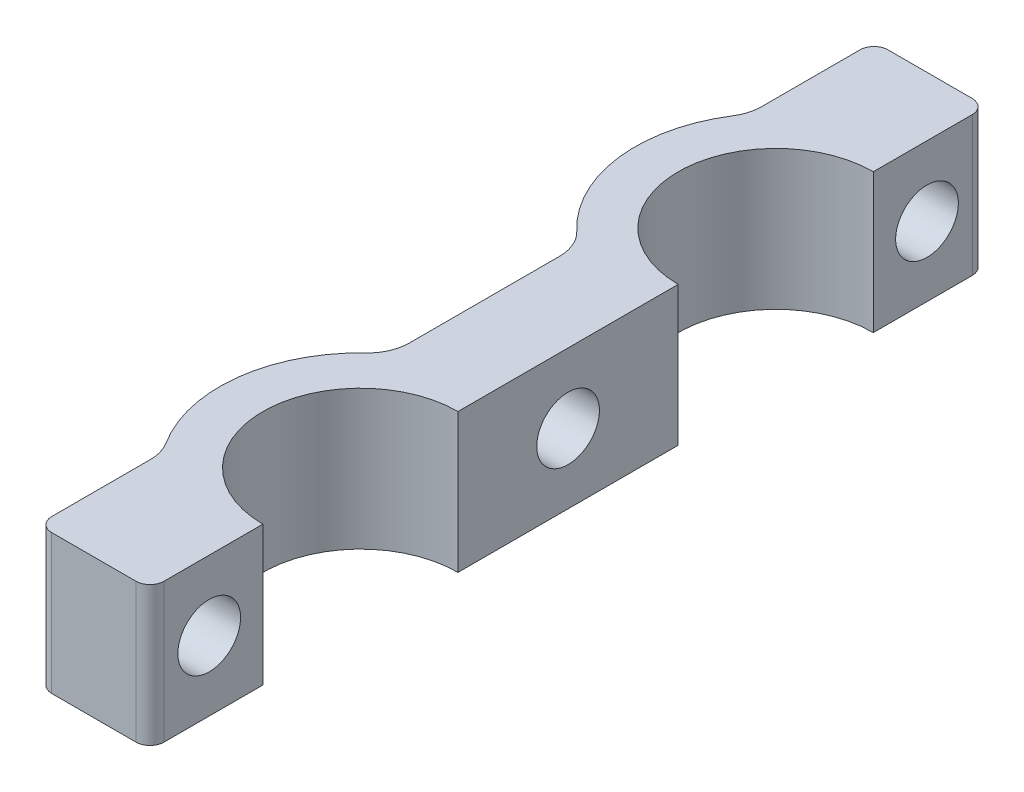
ISO-10303-21;
HEADER;
FILE_DESCRIPTION(('STEP AP214'),'2;1');
FILE_NAME('part.step','',(''),(''),'','','');
FILE_SCHEMA(('AUTOMOTIVE_DESIGN { 1 0 10303 214 1 1 1 1 }'));
ENDSEC;
DATA;
#1=APPLICATION_CONTEXT('core data for automotive mechanical design processes');
#2=APPLICATION_PROTOCOL_DEFINITION('international standard','automotive_design',2000,#1);
#3=PRODUCT_CONTEXT('',#1,'mechanical');
#4=PRODUCT('Part','Part','',(#3));
#5=PRODUCT_RELATED_PRODUCT_CATEGORY('part','',(#4));
#6=PRODUCT_DEFINITION_FORMATION('','',#4);
#7=PRODUCT_DEFINITION_CONTEXT('part definition',#1,'design');
#8=PRODUCT_DEFINITION('design','',#6,#7);
#9=PRODUCT_DEFINITION_SHAPE('','',#8);
#10=(LENGTH_UNIT() NAMED_UNIT(*) SI_UNIT(.MILLI.,.METRE.));
#11=(NAMED_UNIT(*) PLANE_ANGLE_UNIT() SI_UNIT($,.RADIAN.));
#12=(NAMED_UNIT(*) SI_UNIT($,.STERADIAN.) SOLID_ANGLE_UNIT());
#13=UNCERTAINTY_MEASURE_WITH_UNIT(LENGTH_MEASURE(1.E-05),#10,'distance_accuracy_value','');
#14=(GEOMETRIC_REPRESENTATION_CONTEXT(3) GLOBAL_UNCERTAINTY_ASSIGNED_CONTEXT((#13)) GLOBAL_UNIT_ASSIGNED_CONTEXT((#10,
#11,#12)) REPRESENTATION_CONTEXT('',''));
#15=CARTESIAN_POINT('',(0.,0.,0.));
#16=DIRECTION('',(0.,0.,1.));
#17=DIRECTION('',(1.,0.,0.));
#18=AXIS2_PLACEMENT_3D('',#15,#16,#17);
#19=CARTESIAN_POINT('',(0.,10.,-44.9));
#20=DIRECTION('',(0.,-1.,0.));
#21=DIRECTION('',(0.,0.,-1.));
#22=AXIS2_PLACEMENT_3D('',#19,#20,#21);
#23=CYLINDRICAL_SURFACE('',#22,10.1);
#24=CARTESIAN_POINT('',(0.,0.,-44.9));
#25=DIRECTION('',(0.,1.,0.));
#26=DIRECTION('',(0.,0.,1.));
#27=AXIS2_PLACEMENT_3D('',#24,#25,#26);
#28=CIRCLE('',#27,10.1);
#29=CARTESIAN_POINT('',(-8.51934592838871,0.,-50.3250110555137));
#30=VERTEX_POINT('',#29);
#31=CARTESIAN_POINT('',(-6.93893129770993,0.,-37.5609787814954));
#32=VERTEX_POINT('',#31);
#33=EDGE_CURVE('E271',#30,#32,#28,.T.);
#34=ORIENTED_EDGE('',*,*,#33,.T.);
#35=DIRECTION('',(0.,-1.,0.));
#36=VECTOR('',#35,1.);
#37=CARTESIAN_POINT('',(-6.93893129770993,10.,-37.5609787814954));
#38=LINE('',#37,#36);
#39=CARTESIAN_POINT('',(-6.93893129770993,10.,-37.5609787814954));
#40=VERTEX_POINT('',#39);
#41=EDGE_CURVE('E288',#32,#40,#38,.F.);
#42=ORIENTED_EDGE('',*,*,#41,.T.);
#43=CARTESIAN_POINT('',(0.,10.,-44.9));
#44=DIRECTION('',(0.,1.,0.));
#45=DIRECTION('',(0.,0.,1.));
#46=AXIS2_PLACEMENT_3D('',#43,#44,#45);
#47=CIRCLE('',#46,10.1);
#48=CARTESIAN_POINT('',(-8.51934592838871,10.,-50.3250110555137));
#49=VERTEX_POINT('',#48);
#50=EDGE_CURVE('E255',#49,#40,#47,.T.);
#51=ORIENTED_EDGE('',*,*,#50,.F.);
#52=DIRECTION('',(0.,-1.,0.));
#53=VECTOR('',#52,1.);
#54=CARTESIAN_POINT('',(-8.51934592838872,10.,-50.3250110555137));
#55=LINE('',#54,#53);
#56=EDGE_CURVE('E286',#49,#30,#55,.T.);
#57=ORIENTED_EDGE('',*,*,#56,.T.);
#58=EDGE_LOOP('',(#34,#42,#51,#57));
#59=FACE_BOUND('',#58,.T.);
#60=ADVANCED_FACE('F35',(#59),#23,.T.);
#61=CARTESIAN_POINT('',(0.,10.,-15.1));
#62=DIRECTION('',(0.,-1.,0.));
#63=DIRECTION('',(0.,0.,-1.));
#64=AXIS2_PLACEMENT_3D('',#61,#62,#63);
#65=CYLINDRICAL_SURFACE('',#64,10.1);
#66=CARTESIAN_POINT('',(0.,10.,-15.1));
#67=DIRECTION('',(0.,1.,0.));
#68=DIRECTION('',(0.,0.,-1.));
#69=AXIS2_PLACEMENT_3D('',#66,#67,#68);
#70=CIRCLE('',#69,10.1);
#71=CARTESIAN_POINT('',(-6.93893129770993,10.,-22.4390212185047));
#72=VERTEX_POINT('',#71);
#73=CARTESIAN_POINT('',(-8.51934592838876,10.,-9.6749889444863));
#74=VERTEX_POINT('',#73);
#75=EDGE_CURVE('E258',#72,#74,#70,.T.);
#76=ORIENTED_EDGE('',*,*,#75,.F.);
#77=DIRECTION('',(0.,-1.,0.));
#78=VECTOR('',#77,1.);
#79=CARTESIAN_POINT('',(-6.93893129770993,10.,-22.4390212185047));
#80=LINE('',#79,#78);
#81=CARTESIAN_POINT('',(-6.93893129770993,0.,-22.4390212185047));
#82=VERTEX_POINT('',#81);
#83=EDGE_CURVE('E278',#72,#82,#80,.T.);
#84=ORIENTED_EDGE('',*,*,#83,.T.);
#85=CARTESIAN_POINT('',(0.,0.,-15.1));
#86=DIRECTION('',(0.,1.,0.));
#87=DIRECTION('',(0.,0.,-1.));
#88=AXIS2_PLACEMENT_3D('',#85,#86,#87);
#89=CIRCLE('',#88,10.1);
#90=CARTESIAN_POINT('',(-8.51934592838876,0.,-9.6749889444863));
#91=VERTEX_POINT('',#90);
#92=EDGE_CURVE('E251',#82,#91,#89,.T.);
#93=ORIENTED_EDGE('',*,*,#92,.T.);
#94=DIRECTION('',(0.,-1.,0.));
#95=VECTOR('',#94,1.);
#96=CARTESIAN_POINT('',(-8.51934592838876,10.,-9.6749889444863));
#97=LINE('',#96,#95);
#98=EDGE_CURVE('E261',#91,#74,#97,.F.);
#99=ORIENTED_EDGE('',*,*,#98,.T.);
#100=EDGE_LOOP('',(#76,#84,#93,#99));
#101=FACE_BOUND('',#100,.T.);
#102=ADVANCED_FACE('F399',(#101),#65,.T.);
#103=CARTESIAN_POINT('',(-3.,10.,0.));
#104=DIRECTION('',(0.,0.,-1.));
#105=DIRECTION('',(-1.,0.,0.));
#106=AXIS2_PLACEMENT_3D('',#103,#104,#105);
#107=PLANE('',#106);
#108=DIRECTION('',(1.,0.,0.));
#109=VECTOR('',#108,1.);
#110=CARTESIAN_POINT('',(-3.,0.,0.));
#111=LINE('',#110,#109);
#112=CARTESIAN_POINT('',(-7.0498447189993,0.,0.));
#113=VERTEX_POINT('',#112);
#114=CARTESIAN_POINT('',(-1.,0.,0.));
#115=VERTEX_POINT('',#114);
#116=EDGE_CURVE('E247',#113,#115,#111,.T.);
#117=ORIENTED_EDGE('',*,*,#116,.T.);
#118=DIRECTION('',(0.,-1.,0.));
#119=VECTOR('',#118,1.);
#120=CARTESIAN_POINT('',(-1.,10.,0.));
#121=LINE('',#120,#119);
#122=CARTESIAN_POINT('',(-1.,10.,0.));
#123=VERTEX_POINT('',#122);
#124=EDGE_CURVE('E11',#115,#123,#121,.F.);
#125=ORIENTED_EDGE('',*,*,#124,.T.);
#126=DIRECTION('',(1.,0.,0.));
#127=VECTOR('',#126,1.);
#128=CARTESIAN_POINT('',(-3.,10.,0.));
#129=LINE('',#128,#127);
#130=CARTESIAN_POINT('',(-7.0498447189993,10.,0.));
#131=VERTEX_POINT('',#130);
#132=EDGE_CURVE('E248',#131,#123,#129,.T.);
#133=ORIENTED_EDGE('',*,*,#132,.F.);
#134=DIRECTION('',(0.,1.,0.));
#135=VECTOR('',#134,1.);
#136=CARTESIAN_POINT('',(-7.0498447189993,0.,0.));
#137=LINE('',#136,#135);
#138=EDGE_CURVE('E319',#131,#113,#137,.F.);
#139=ORIENTED_EDGE('',*,*,#138,.T.);
#140=EDGE_LOOP('',(#117,#125,#133,#139));
#141=FACE_BOUND('',#140,.T.);
#142=ADVANCED_FACE('F415',(#141),#107,.F.);
#143=CARTESIAN_POINT('',(0.,10.,0.));
#144=DIRECTION('',(-1.,0.,0.));
#145=DIRECTION('',(0.,0.,1.));
#146=AXIS2_PLACEMENT_3D('',#143,#144,#145);
#147=PLANE('',#146);
#148=CARTESIAN_POINT('',(0.,5.,-4.25000000000001));
#149=DIRECTION('',(-1.,0.,0.));
#150=DIRECTION('',(0.,0.,-1.));
#151=AXIS2_PLACEMENT_3D('',#148,#149,#150);
#152=CIRCLE('',#151,2.25);
#153=CARTESIAN_POINT('',(0.,5.,-6.50000000000001));
#154=VERTEX_POINT('',#153);
#155=EDGE_CURVE('E228',#154,#154,#152,.T.);
#156=ORIENTED_EDGE('',*,*,#155,.T.);
#157=EDGE_LOOP('',(#156));
#158=FACE_BOUND('',#157,.T.);
#159=DIRECTION('',(0.,0.,-1.));
#160=VECTOR('',#159,1.);
#161=CARTESIAN_POINT('',(0.,10.,0.));
#162=LINE('',#161,#160);
#163=CARTESIAN_POINT('',(0.,10.,-1.));
#164=VERTEX_POINT('',#163);
#165=CARTESIAN_POINT('',(0.,10.,-8.1));
#166=VERTEX_POINT('',#165);
#167=EDGE_CURVE('E250',#164,#166,#162,.T.);
#168=ORIENTED_EDGE('',*,*,#167,.F.);
#169=DIRECTION('',(0.,-1.,0.));
#170=VECTOR('',#169,1.);
#171=CARTESIAN_POINT('',(0.,10.,-1.));
#172=LINE('',#171,#170);
#173=CARTESIAN_POINT('',(0.,0.,-1.));
#174=VERTEX_POINT('',#173);
#175=EDGE_CURVE('E43',#164,#174,#172,.T.);
#176=ORIENTED_EDGE('',*,*,#175,.T.);
#177=DIRECTION('',(0.,0.,-1.));
#178=VECTOR('',#177,1.);
#179=CARTESIAN_POINT('',(0.,0.,0.));
#180=LINE('',#179,#178);
#181=CARTESIAN_POINT('',(0.,0.,-8.1));
#182=VERTEX_POINT('',#181);
#183=EDGE_CURVE('E263',#174,#182,#180,.T.);
#184=ORIENTED_EDGE('',*,*,#183,.T.);
#185=DIRECTION('',(0.,-1.,0.));
#186=VECTOR('',#185,1.);
#187=CARTESIAN_POINT('',(0.,10.,-8.1));
#188=LINE('',#187,#186);
#189=EDGE_CURVE('E208',#166,#182,#188,.T.);
#190=ORIENTED_EDGE('',*,*,#189,.F.);
#191=EDGE_LOOP('',(#168,#176,#184,#190));
#192=FACE_BOUND('',#191,.T.);
#193=ADVANCED_FACE('F345',(#158,#192),#147,.F.);
#194=CARTESIAN_POINT('',(0.,10.,-37.8));
#195=DIRECTION('',(-1.,0.,0.));
#196=DIRECTION('',(0.,0.,1.));
#197=AXIS2_PLACEMENT_3D('',#194,#195,#196);
#198=PLANE('',#197);
#199=CARTESIAN_POINT('',(0.,5.,-30.));
#200=DIRECTION('',(-1.,0.,0.));
#201=DIRECTION('',(0.,0.,1.));
#202=AXIS2_PLACEMENT_3D('',#199,#200,#201);
#203=CIRCLE('',#202,2.25);
#204=CARTESIAN_POINT('',(0.,5.,-27.75));
#205=VERTEX_POINT('',#204);
#206=EDGE_CURVE('E214',#205,#205,#203,.T.);
#207=ORIENTED_EDGE('',*,*,#206,.T.);
#208=EDGE_LOOP('',(#207));
#209=FACE_BOUND('',#208,.T.);
#210=DIRECTION('',(0.,0.,-1.));
#211=VECTOR('',#210,1.);
#212=CARTESIAN_POINT('',(0.,0.,-37.8));
#213=LINE('',#212,#211);
#214=CARTESIAN_POINT('',(0.,0.,-22.1));
#215=VERTEX_POINT('',#214);
#216=CARTESIAN_POINT('',(0.,0.,-37.9));
#217=VERTEX_POINT('',#216);
#218=EDGE_CURVE('E265',#215,#217,#213,.T.);
#219=ORIENTED_EDGE('',*,*,#218,.T.);
#220=DIRECTION('',(0.,-1.,0.));
#221=VECTOR('',#220,1.);
#222=CARTESIAN_POINT('',(0.,10.,-37.9));
#223=LINE('',#222,#221);
#224=CARTESIAN_POINT('',(0.,10.,-37.9));
#225=VERTEX_POINT('',#224);
#226=EDGE_CURVE('E192',#225,#217,#223,.T.);
#227=ORIENTED_EDGE('',*,*,#226,.F.);
#228=DIRECTION('',(0.,0.,-1.));
#229=VECTOR('',#228,1.);
#230=CARTESIAN_POINT('',(0.,10.,-37.8));
#231=LINE('',#230,#229);
#232=CARTESIAN_POINT('',(0.,10.,-22.1));
#233=VERTEX_POINT('',#232);
#234=EDGE_CURVE('E183',#233,#225,#231,.T.);
#235=ORIENTED_EDGE('',*,*,#234,.F.);
#236=DIRECTION('',(0.,-1.,0.));
#237=VECTOR('',#236,1.);
#238=CARTESIAN_POINT('',(0.,10.,-22.1));
#239=LINE('',#238,#237);
#240=EDGE_CURVE('E205',#233,#215,#239,.T.);
#241=ORIENTED_EDGE('',*,*,#240,.T.);
#242=EDGE_LOOP('',(#219,#227,#235,#241));
#243=FACE_BOUND('',#242,.T.);
#244=ADVANCED_FACE('F357',(#209,#243),#198,.F.);
#245=CARTESIAN_POINT('',(0.,10.,-60.));
#246=DIRECTION('',(-1.,0.,0.));
#247=DIRECTION('',(0.,0.,1.));
#248=AXIS2_PLACEMENT_3D('',#245,#246,#247);
#249=PLANE('',#248);
#250=CARTESIAN_POINT('',(0.,5.,-55.75));
#251=DIRECTION('',(-1.,0.,0.));
#252=DIRECTION('',(0.,0.,1.));
#253=AXIS2_PLACEMENT_3D('',#250,#251,#252);
#254=CIRCLE('',#253,2.25);
#255=CARTESIAN_POINT('',(0.,5.,-53.5));
#256=VERTEX_POINT('',#255);
#257=EDGE_CURVE('E234',#256,#256,#254,.T.);
#258=ORIENTED_EDGE('',*,*,#257,.T.);
#259=EDGE_LOOP('',(#258));
#260=FACE_BOUND('',#259,.T.);
#261=DIRECTION('',(0.,0.,-1.));
#262=VECTOR('',#261,1.);
#263=CARTESIAN_POINT('',(0.,0.,-60.));
#264=LINE('',#263,#262);
#265=CARTESIAN_POINT('',(0.,0.,-51.9));
#266=VERTEX_POINT('',#265);
#267=CARTESIAN_POINT('',(0.,0.,-59.));
#268=VERTEX_POINT('',#267);
#269=EDGE_CURVE('E267',#266,#268,#264,.T.);
#270=ORIENTED_EDGE('',*,*,#269,.T.);
#271=DIRECTION('',(0.,-1.,0.));
#272=VECTOR('',#271,1.);
#273=CARTESIAN_POINT('',(0.,10.,-59.));
#274=LINE('',#273,#272);
#275=CARTESIAN_POINT('',(0.,10.,-59.));
#276=VERTEX_POINT('',#275);
#277=EDGE_CURVE('E179',#268,#276,#274,.F.);
#278=ORIENTED_EDGE('',*,*,#277,.T.);
#279=DIRECTION('',(0.,0.,-1.));
#280=VECTOR('',#279,1.);
#281=CARTESIAN_POINT('',(0.,10.,-60.));
#282=LINE('',#281,#280);
#283=CARTESIAN_POINT('',(0.,10.,-51.9));
#284=VERTEX_POINT('',#283);
#285=EDGE_CURVE('E172',#284,#276,#282,.T.);
#286=ORIENTED_EDGE('',*,*,#285,.F.);
#287=DIRECTION('',(0.,-1.,0.));
#288=VECTOR('',#287,1.);
#289=CARTESIAN_POINT('',(0.,10.,-51.9));
#290=LINE('',#289,#288);
#291=EDGE_CURVE('E176',#284,#266,#290,.T.);
#292=ORIENTED_EDGE('',*,*,#291,.T.);
#293=EDGE_LOOP('',(#270,#278,#286,#292));
#294=FACE_BOUND('',#293,.T.);
#295=ADVANCED_FACE('F175',(#260,#294),#249,.F.);
#296=CARTESIAN_POINT('',(-3.,10.,-60.));
#297=DIRECTION('',(0.,0.,1.));
#298=DIRECTION('',(1.,0.,0.));
#299=AXIS2_PLACEMENT_3D('',#296,#297,#298);
#300=PLANE('',#299);
#301=DIRECTION('',(-1.,0.,0.));
#302=VECTOR('',#301,1.);
#303=CARTESIAN_POINT('',(-3.,10.,-60.));
#304=LINE('',#303,#302);
#305=CARTESIAN_POINT('',(-1.,10.,-60.));
#306=VERTEX_POINT('',#305);
#307=CARTESIAN_POINT('',(-7.04984471899923,10.,-60.));
#308=VERTEX_POINT('',#307);
#309=EDGE_CURVE('E182',#306,#308,#304,.T.);
#310=ORIENTED_EDGE('',*,*,#309,.F.);
#311=DIRECTION('',(0.,-1.,0.));
#312=VECTOR('',#311,1.);
#313=CARTESIAN_POINT('',(-1.,10.,-60.));
#314=LINE('',#313,#312);
#315=CARTESIAN_POINT('',(-1.,0.,-60.));
#316=VERTEX_POINT('',#315);
#317=EDGE_CURVE('E331',#306,#316,#314,.T.);
#318=ORIENTED_EDGE('',*,*,#317,.T.);
#319=DIRECTION('',(-1.,0.,0.));
#320=VECTOR('',#319,1.);
#321=CARTESIAN_POINT('',(-3.,0.,-60.));
#322=LINE('',#321,#320);
#323=CARTESIAN_POINT('',(-7.04984471899923,0.,-60.));
#324=VERTEX_POINT('',#323);
#325=EDGE_CURVE('E269',#316,#324,#322,.T.);
#326=ORIENTED_EDGE('',*,*,#325,.T.);
#327=DIRECTION('',(0.,1.,0.));
#328=VECTOR('',#327,1.);
#329=CARTESIAN_POINT('',(-7.04984471899923,10.,-60.));
#330=LINE('',#329,#328);
#331=EDGE_CURVE('E326',#324,#308,#330,.T.);
#332=ORIENTED_EDGE('',*,*,#331,.T.);
#333=EDGE_LOOP('',(#310,#318,#326,#332));
#334=FACE_BOUND('',#333,.T.);
#335=ADVANCED_FACE('F364',(#334),#300,.F.);
#336=CARTESIAN_POINT('',(0.,10.,-15.1));
#337=DIRECTION('',(0.,-1.,0.));
#338=DIRECTION('',(0.,0.,-1.));
#339=AXIS2_PLACEMENT_3D('',#336,#337,#338);
#340=PLANE('',#339);
#341=ORIENTED_EDGE('',*,*,#285,.T.);
#342=CARTESIAN_POINT('',(-1.,10.,-59.));
#343=DIRECTION('',(0.,-1.,0.));
#344=DIRECTION('',(0.,0.,-1.));
#345=AXIS2_PLACEMENT_3D('',#342,#343,#344);
#346=CIRCLE('',#345,1.);
#347=EDGE_CURVE('E340',#276,#306,#346,.F.);
#348=ORIENTED_EDGE('',*,*,#347,.T.);
#349=ORIENTED_EDGE('',*,*,#309,.T.);
#350=CARTESIAN_POINT('',(-7.04984471899923,10.,-59.));
#351=DIRECTION('',(0.,-1.,0.));
#352=DIRECTION('',(0.,0.,-1.));
#353=AXIS2_PLACEMENT_3D('',#350,#351,#352);
#354=CIRCLE('',#353,1.);
#355=CARTESIAN_POINT('',(-8.04984471899923,10.,-59.));
#356=VERTEX_POINT('',#355);
#357=EDGE_CURVE('E315',#308,#356,#354,.F.);
#358=ORIENTED_EDGE('',*,*,#357,.T.);
#359=DIRECTION('',(0.,0.,1.));
#360=VECTOR('',#359,1.);
#361=CARTESIAN_POINT('',(-8.04984471899923,10.,-60.));
#362=LINE('',#361,#360);
#363=CARTESIAN_POINT('',(-8.04984471899923,10.,-51.9364004779436));
#364=VERTEX_POINT('',#363);
#365=EDGE_CURVE('E243',#356,#364,#362,.T.);
#366=ORIENTED_EDGE('',*,*,#365,.T.);
#367=CARTESIAN_POINT('',(-11.0498447189992,10.,-51.9364004779436));
#368=DIRECTION('',(0.,-1.,0.));
#369=DIRECTION('',(0.,0.,-1.));
#370=AXIS2_PLACEMENT_3D('',#367,#368,#369);
#371=CIRCLE('',#370,3.);
#372=EDGE_CURVE('E307',#364,#49,#371,.T.);
#373=ORIENTED_EDGE('',*,*,#372,.T.);
#374=ORIENTED_EDGE('',*,*,#50,.T.);
#375=CARTESIAN_POINT('',(-9.00000000000001,10.,-35.3810714888702));
#376=DIRECTION('',(0.,-1.,0.));
#377=DIRECTION('',(0.,0.,-1.));
#378=AXIS2_PLACEMENT_3D('',#375,#376,#377);
#379=CIRCLE('',#378,3.);
#380=CARTESIAN_POINT('',(-6.00000000000001,10.,-35.3810714888702));
#381=VERTEX_POINT('',#380);
#382=EDGE_CURVE('E301',#40,#381,#379,.T.);
#383=ORIENTED_EDGE('',*,*,#382,.T.);
#384=DIRECTION('',(0.,0.,1.));
#385=VECTOR('',#384,1.);
#386=CARTESIAN_POINT('',(-6.00000000000001,10.,-36.7753461612202));
#387=LINE('',#386,#385);
#388=CARTESIAN_POINT('',(-6.00000000000001,10.,-24.6189285111298));
#389=VERTEX_POINT('',#388);
#390=EDGE_CURVE('E220',#381,#389,#387,.T.);
#391=ORIENTED_EDGE('',*,*,#390,.T.);
#392=CARTESIAN_POINT('',(-9.00000000000001,10.,-24.6189285111298));
#393=DIRECTION('',(0.,-1.,0.));
#394=DIRECTION('',(0.,0.,-1.));
#395=AXIS2_PLACEMENT_3D('',#392,#393,#394);
#396=CIRCLE('',#395,3.);
#397=EDGE_CURVE('E297',#389,#72,#396,.T.);
#398=ORIENTED_EDGE('',*,*,#397,.T.);
#399=ORIENTED_EDGE('',*,*,#75,.T.);
#400=CARTESIAN_POINT('',(-11.0498447189993,10.,-8.06359952205648));
#401=DIRECTION('',(0.,-1.,0.));
#402=DIRECTION('',(0.,0.,-1.));
#403=AXIS2_PLACEMENT_3D('',#400,#401,#402);
#404=CIRCLE('',#403,3.);
#405=CARTESIAN_POINT('',(-8.04984471899928,10.,-8.06359952205648));
#406=VERTEX_POINT('',#405);
#407=EDGE_CURVE('E303',#74,#406,#404,.T.);
#408=ORIENTED_EDGE('',*,*,#407,.T.);
#409=DIRECTION('',(0.,0.,1.));
#410=VECTOR('',#409,1.);
#411=CARTESIAN_POINT('',(-8.0498447189993,10.,0.));
#412=LINE('',#411,#410);
#413=CARTESIAN_POINT('',(-8.0498447189993,10.,-1.));
#414=VERTEX_POINT('',#413);
#415=EDGE_CURVE('E237',#406,#414,#412,.T.);
#416=ORIENTED_EDGE('',*,*,#415,.T.);
#417=CARTESIAN_POINT('',(-7.0498447189993,10.,-1.));
#418=DIRECTION('',(0.,-1.,0.));
#419=DIRECTION('',(0.,0.,-1.));
#420=AXIS2_PLACEMENT_3D('',#417,#418,#419);
#421=CIRCLE('',#420,1.);
#422=EDGE_CURVE('E317',#414,#131,#421,.F.);
#423=ORIENTED_EDGE('',*,*,#422,.T.);
#424=ORIENTED_EDGE('',*,*,#132,.T.);
#425=CARTESIAN_POINT('',(-1.,10.,-1.));
#426=DIRECTION('',(0.,-1.,0.));
#427=DIRECTION('',(0.,0.,-1.));
#428=AXIS2_PLACEMENT_3D('',#425,#426,#427);
#429=CIRCLE('',#428,1.);
#430=EDGE_CURVE('E50',#123,#164,#429,.F.);
#431=ORIENTED_EDGE('',*,*,#430,.T.);
#432=ORIENTED_EDGE('',*,*,#167,.T.);
#433=CARTESIAN_POINT('',(0.,10.,-15.1));
#434=DIRECTION('',(0.,1.,0.));
#435=DIRECTION('',(0.,0.,-1.));
#436=AXIS2_PLACEMENT_3D('',#433,#434,#435);
#437=CIRCLE('',#436,7.);
#438=EDGE_CURVE('E202',#233,#166,#437,.T.);
#439=ORIENTED_EDGE('',*,*,#438,.F.);
#440=ORIENTED_EDGE('',*,*,#234,.T.);
#441=CARTESIAN_POINT('',(0.,10.,-44.9));
#442=DIRECTION('',(0.,1.,0.));
#443=DIRECTION('',(0.,0.,-1.));
#444=AXIS2_PLACEMENT_3D('',#441,#442,#443);
#445=CIRCLE('',#444,6.99999999999999);
#446=EDGE_CURVE('E189',#284,#225,#445,.T.);
#447=ORIENTED_EDGE('',*,*,#446,.F.);
#448=EDGE_LOOP('',(#341,#348,#349,#358,#366,#373,#374,#383,#391,#398,#399,#408,#416,#423,#424,
#431,#432,#439,#440,#447));
#449=FACE_BOUND('',#448,.T.);
#450=ADVANCED_FACE('F194',(#449),#340,.F.);
#451=CARTESIAN_POINT('',(0.,0.,-15.1));
#452=DIRECTION('',(0.,-1.,0.));
#453=DIRECTION('',(0.,0.,-1.));
#454=AXIS2_PLACEMENT_3D('',#451,#452,#453);
#455=PLANE('',#454);
#456=ORIENTED_EDGE('',*,*,#325,.F.);
#457=CARTESIAN_POINT('',(-1.,0.,-59.));
#458=DIRECTION('',(0.,-1.,0.));
#459=DIRECTION('',(0.,0.,-1.));
#460=AXIS2_PLACEMENT_3D('',#457,#458,#459);
#461=CIRCLE('',#460,1.);
#462=EDGE_CURVE('E336',#316,#268,#461,.T.);
#463=ORIENTED_EDGE('',*,*,#462,.T.);
#464=ORIENTED_EDGE('',*,*,#269,.F.);
#465=CARTESIAN_POINT('',(0.,0.,-44.9));
#466=DIRECTION('',(0.,1.,0.));
#467=DIRECTION('',(0.,0.,-1.));
#468=AXIS2_PLACEMENT_3D('',#465,#466,#467);
#469=CIRCLE('',#468,6.99999999999999);
#470=EDGE_CURVE('E191',#266,#217,#469,.T.);
#471=ORIENTED_EDGE('',*,*,#470,.T.);
#472=ORIENTED_EDGE('',*,*,#218,.F.);
#473=CARTESIAN_POINT('',(0.,0.,-15.1));
#474=DIRECTION('',(0.,1.,0.));
#475=DIRECTION('',(0.,0.,-1.));
#476=AXIS2_PLACEMENT_3D('',#473,#474,#475);
#477=CIRCLE('',#476,7.);
#478=EDGE_CURVE('E200',#215,#182,#477,.T.);
#479=ORIENTED_EDGE('',*,*,#478,.T.);
#480=ORIENTED_EDGE('',*,*,#183,.F.);
#481=CARTESIAN_POINT('',(-1.,0.,-1.));
#482=DIRECTION('',(0.,-1.,0.));
#483=DIRECTION('',(0.,0.,-1.));
#484=AXIS2_PLACEMENT_3D('',#481,#482,#483);
#485=CIRCLE('',#484,1.);
#486=EDGE_CURVE('E334',#174,#115,#485,.T.);
#487=ORIENTED_EDGE('',*,*,#486,.T.);
#488=ORIENTED_EDGE('',*,*,#116,.F.);
#489=CARTESIAN_POINT('',(-7.0498447189993,0.,-1.));
#490=DIRECTION('',(0.,-1.,0.));
#491=DIRECTION('',(0.,0.,-1.));
#492=AXIS2_PLACEMENT_3D('',#489,#490,#491);
#493=CIRCLE('',#492,1.);
#494=CARTESIAN_POINT('',(-8.0498447189993,0.,-1.));
#495=VERTEX_POINT('',#494);
#496=EDGE_CURVE('E324',#113,#495,#493,.T.);
#497=ORIENTED_EDGE('',*,*,#496,.T.);
#498=DIRECTION('',(0.,0.,1.));
#499=VECTOR('',#498,1.);
#500=CARTESIAN_POINT('',(-8.0498447189993,0.,0.));
#501=LINE('',#500,#499);
#502=CARTESIAN_POINT('',(-8.04984471899928,0.,-8.06359952205648));
#503=VERTEX_POINT('',#502);
#504=EDGE_CURVE('E240',#503,#495,#501,.T.);
#505=ORIENTED_EDGE('',*,*,#504,.F.);
#506=CARTESIAN_POINT('',(-11.0498447189993,0.,-8.06359952205648));
#507=DIRECTION('',(0.,-1.,0.));
#508=DIRECTION('',(0.,0.,-1.));
#509=AXIS2_PLACEMENT_3D('',#506,#507,#508);
#510=CIRCLE('',#509,3.);
#511=EDGE_CURVE('E305',#503,#91,#510,.F.);
#512=ORIENTED_EDGE('',*,*,#511,.T.);
#513=ORIENTED_EDGE('',*,*,#92,.F.);
#514=CARTESIAN_POINT('',(-9.00000000000001,0.,-24.6189285111298));
#515=DIRECTION('',(0.,-1.,0.));
#516=DIRECTION('',(0.,0.,-1.));
#517=AXIS2_PLACEMENT_3D('',#514,#515,#516);
#518=CIRCLE('',#517,3.);
#519=CARTESIAN_POINT('',(-6.00000000000001,0.,-24.6189285111298));
#520=VERTEX_POINT('',#519);
#521=EDGE_CURVE('E295',#82,#520,#518,.F.);
#522=ORIENTED_EDGE('',*,*,#521,.T.);
#523=DIRECTION('',(0.,0.,1.));
#524=VECTOR('',#523,1.);
#525=CARTESIAN_POINT('',(-6.00000000000001,0.,-36.7753461612202));
#526=LINE('',#525,#524);
#527=CARTESIAN_POINT('',(-6.00000000000001,0.,-35.3810714888702));
#528=VERTEX_POINT('',#527);
#529=EDGE_CURVE('E217',#528,#520,#526,.T.);
#530=ORIENTED_EDGE('',*,*,#529,.F.);
#531=CARTESIAN_POINT('',(-9.00000000000001,0.,-35.3810714888702));
#532=DIRECTION('',(0.,-1.,0.));
#533=DIRECTION('',(0.,0.,-1.));
#534=AXIS2_PLACEMENT_3D('',#531,#532,#533);
#535=CIRCLE('',#534,3.);
#536=EDGE_CURVE('E299',#528,#32,#535,.F.);
#537=ORIENTED_EDGE('',*,*,#536,.T.);
#538=ORIENTED_EDGE('',*,*,#33,.F.);
#539=CARTESIAN_POINT('',(-11.0498447189992,0.,-51.9364004779436));
#540=DIRECTION('',(0.,-1.,0.));
#541=DIRECTION('',(0.,0.,-1.));
#542=AXIS2_PLACEMENT_3D('',#539,#540,#541);
#543=CIRCLE('',#542,3.);
#544=CARTESIAN_POINT('',(-8.04984471899923,0.,-51.9364004779436));
#545=VERTEX_POINT('',#544);
#546=EDGE_CURVE('E309',#30,#545,#543,.F.);
#547=ORIENTED_EDGE('',*,*,#546,.T.);
#548=DIRECTION('',(0.,0.,1.));
#549=VECTOR('',#548,1.);
#550=CARTESIAN_POINT('',(-8.04984471899923,0.,-60.));
#551=LINE('',#550,#549);
#552=CARTESIAN_POINT('',(-8.04984471899923,0.,-59.));
#553=VERTEX_POINT('',#552);
#554=EDGE_CURVE('E245',#553,#545,#551,.T.);
#555=ORIENTED_EDGE('',*,*,#554,.F.);
#556=CARTESIAN_POINT('',(-7.04984471899923,0.,-59.));
#557=DIRECTION('',(0.,-1.,0.));
#558=DIRECTION('',(0.,0.,-1.));
#559=AXIS2_PLACEMENT_3D('',#556,#557,#558);
#560=CIRCLE('',#559,1.);
#561=EDGE_CURVE('E321',#553,#324,#560,.T.);
#562=ORIENTED_EDGE('',*,*,#561,.T.);
#563=EDGE_LOOP('',(#456,#463,#464,#471,#472,#479,#480,#487,#488,#497,#505,#512,#513,#522,#530,
#537,#538,#547,#555,#562));
#564=FACE_BOUND('',#563,.T.);
#565=ADVANCED_FACE('F350',(#564),#455,.T.);
#566=CARTESIAN_POINT('',(-8.04984471899923,-10.3199288605109,-60.));
#567=DIRECTION('',(-1.,0.,0.));
#568=DIRECTION('',(0.,0.,1.));
#569=AXIS2_PLACEMENT_3D('',#566,#567,#568);
#570=PLANE('',#569);
#571=CARTESIAN_POINT('',(-8.04984471899923,5.,-55.75));
#572=DIRECTION('',(-1.,0.,0.));
#573=DIRECTION('',(0.,0.,1.));
#574=AXIS2_PLACEMENT_3D('',#571,#572,#573);
#575=CIRCLE('',#574,2.25);
#576=CARTESIAN_POINT('',(-8.04984471899923,5.,-53.5));
#577=VERTEX_POINT('',#576);
#578=EDGE_CURVE('E231',#577,#577,#575,.T.);
#579=ORIENTED_EDGE('',*,*,#578,.F.);
#580=EDGE_LOOP('',(#579));
#581=FACE_BOUND('',#580,.T.);
#582=ORIENTED_EDGE('',*,*,#365,.F.);
#583=DIRECTION('',(0.,1.,0.));
#584=VECTOR('',#583,1.);
#585=CARTESIAN_POINT('',(-8.04984471899923,0.,-59.));
#586=LINE('',#585,#584);
#587=EDGE_CURVE('E329',#356,#553,#586,.F.);
#588=ORIENTED_EDGE('',*,*,#587,.T.);
#589=ORIENTED_EDGE('',*,*,#554,.T.);
#590=DIRECTION('',(0.,-1.,0.));
#591=VECTOR('',#590,1.);
#592=CARTESIAN_POINT('',(-8.04984471899923,-10.3199288605109,-51.9364004779436));
#593=LINE('',#592,#591);
#594=EDGE_CURVE('E292',#545,#364,#593,.F.);
#595=ORIENTED_EDGE('',*,*,#594,.T.);
#596=EDGE_LOOP('',(#582,#588,#589,#595));
#597=FACE_BOUND('',#596,.T.);
#598=ADVANCED_FACE('F373',(#581,#597),#570,.T.);
#599=CARTESIAN_POINT('',(-8.0498447189993,-10.3199288605109,0.));
#600=DIRECTION('',(-1.,0.,0.));
#601=DIRECTION('',(0.,0.,1.));
#602=AXIS2_PLACEMENT_3D('',#599,#600,#601);
#603=PLANE('',#602);
#604=CARTESIAN_POINT('',(-8.04984471899922,5.,-4.25000000000001));
#605=DIRECTION('',(-1.,0.,0.));
#606=DIRECTION('',(0.,0.,1.));
#607=AXIS2_PLACEMENT_3D('',#604,#605,#606);
#608=CIRCLE('',#607,2.25);
#609=CARTESIAN_POINT('',(-8.04984471899922,5.,-2.00000000000001));
#610=VERTEX_POINT('',#609);
#611=EDGE_CURVE('E223',#610,#610,#608,.T.);
#612=ORIENTED_EDGE('',*,*,#611,.F.);
#613=EDGE_LOOP('',(#612));
#614=FACE_BOUND('',#613,.T.);
#615=ORIENTED_EDGE('',*,*,#504,.T.);
#616=DIRECTION('',(0.,1.,0.));
#617=VECTOR('',#616,1.);
#618=CARTESIAN_POINT('',(-8.0498447189993,10.,-1.));
#619=LINE('',#618,#617);
#620=EDGE_CURVE('E312',#495,#414,#619,.T.);
#621=ORIENTED_EDGE('',*,*,#620,.T.);
#622=ORIENTED_EDGE('',*,*,#415,.F.);
#623=DIRECTION('',(0.,-1.,0.));
#624=VECTOR('',#623,1.);
#625=CARTESIAN_POINT('',(-8.04984471899928,-10.3199288605109,-8.06359952205648));
#626=LINE('',#625,#624);
#627=EDGE_CURVE('E290',#406,#503,#626,.T.);
#628=ORIENTED_EDGE('',*,*,#627,.T.);
#629=EDGE_LOOP('',(#615,#621,#622,#628));
#630=FACE_BOUND('',#629,.T.);
#631=ADVANCED_FACE('F408',(#614,#630),#603,.T.);
#632=CARTESIAN_POINT('',(0.,5.,-55.75));
#633=DIRECTION('',(-1.,0.,0.));
#634=DIRECTION('',(0.,0.,1.));
#635=AXIS2_PLACEMENT_3D('',#632,#633,#634);
#636=CYLINDRICAL_SURFACE('',#635,2.25);
#637=ORIENTED_EDGE('',*,*,#257,.F.);
#638=EDGE_LOOP('',(#637));
#639=FACE_BOUND('',#638,.T.);
#640=ORIENTED_EDGE('',*,*,#578,.T.);
#641=EDGE_LOOP('',(#640));
#642=FACE_BOUND('',#641,.T.);
#643=ADVANCED_FACE('F471',(#639,#642),#636,.F.);
#644=CARTESIAN_POINT('',(0.,5.,-4.25000000000001));
#645=DIRECTION('',(-1.,0.,0.));
#646=DIRECTION('',(0.,0.,1.));
#647=AXIS2_PLACEMENT_3D('',#644,#645,#646);
#648=CYLINDRICAL_SURFACE('',#647,2.25);
#649=ORIENTED_EDGE('',*,*,#155,.F.);
#650=EDGE_LOOP('',(#649));
#651=FACE_BOUND('',#650,.T.);
#652=ORIENTED_EDGE('',*,*,#611,.T.);
#653=EDGE_LOOP('',(#652));
#654=FACE_BOUND('',#653,.T.);
#655=ADVANCED_FACE('F467',(#651,#654),#648,.F.);
#656=CARTESIAN_POINT('',(-6.00000000000001,10.,-36.7753461612202));
#657=DIRECTION('',(1.,0.,0.));
#658=DIRECTION('',(0.,0.,-1.));
#659=AXIS2_PLACEMENT_3D('',#656,#657,#658);
#660=PLANE('',#659);
#661=CARTESIAN_POINT('',(-6.00000000000001,5.,-30.));
#662=DIRECTION('',(-1.,0.,0.));
#663=DIRECTION('',(0.,0.,1.));
#664=AXIS2_PLACEMENT_3D('',#661,#662,#663);
#665=CIRCLE('',#664,2.25);
#666=CARTESIAN_POINT('',(-6.00000000000001,5.,-27.75));
#667=VERTEX_POINT('',#666);
#668=EDGE_CURVE('E211',#667,#667,#665,.T.);
#669=ORIENTED_EDGE('',*,*,#668,.F.);
#670=EDGE_LOOP('',(#669));
#671=FACE_BOUND('',#670,.T.);
#672=ORIENTED_EDGE('',*,*,#529,.T.);
#673=DIRECTION('',(0.,1.,0.));
#674=VECTOR('',#673,1.);
#675=CARTESIAN_POINT('',(-6.00000000000001,10.,-24.6189285111298));
#676=LINE('',#675,#674);
#677=EDGE_CURVE('E284',#520,#389,#676,.T.);
#678=ORIENTED_EDGE('',*,*,#677,.T.);
#679=ORIENTED_EDGE('',*,*,#390,.F.);
#680=DIRECTION('',(0.,1.,0.));
#681=VECTOR('',#680,1.);
#682=CARTESIAN_POINT('',(-6.00000000000001,0.,-35.3810714888702));
#683=LINE('',#682,#681);
#684=EDGE_CURVE('E281',#381,#528,#683,.F.);
#685=ORIENTED_EDGE('',*,*,#684,.T.);
#686=EDGE_LOOP('',(#672,#678,#679,#685));
#687=FACE_BOUND('',#686,.T.);
#688=ADVANCED_FACE('F391',(#671,#687),#660,.F.);
#689=CARTESIAN_POINT('',(0.,5.,-30.));
#690=DIRECTION('',(-1.,0.,0.));
#691=DIRECTION('',(0.,0.,1.));
#692=AXIS2_PLACEMENT_3D('',#689,#690,#691);
#693=CYLINDRICAL_SURFACE('',#692,2.25);
#694=ORIENTED_EDGE('',*,*,#206,.F.);
#695=EDGE_LOOP('',(#694));
#696=FACE_BOUND('',#695,.T.);
#697=ORIENTED_EDGE('',*,*,#668,.T.);
#698=EDGE_LOOP('',(#697));
#699=FACE_BOUND('',#698,.T.);
#700=ADVANCED_FACE('F443',(#696,#699),#693,.F.);
#701=CARTESIAN_POINT('',(-9.00000000000001,10.,-24.6189285111298));
#702=DIRECTION('',(0.,-1.,0.));
#703=DIRECTION('',(0.,0.,-1.));
#704=AXIS2_PLACEMENT_3D('',#701,#702,#703);
#705=CYLINDRICAL_SURFACE('',#704,3.);
#706=ORIENTED_EDGE('',*,*,#397,.F.);
#707=ORIENTED_EDGE('',*,*,#677,.F.);
#708=ORIENTED_EDGE('',*,*,#521,.F.);
#709=ORIENTED_EDGE('',*,*,#83,.F.);
#710=EDGE_LOOP('',(#706,#707,#708,#709));
#711=FACE_BOUND('',#710,.T.);
#712=ADVANCED_FACE('F395',(#711),#705,.F.);
#713=CARTESIAN_POINT('',(-9.00000000000001,10.,-35.3810714888702));
#714=DIRECTION('',(0.,-1.,0.));
#715=DIRECTION('',(0.,0.,-1.));
#716=AXIS2_PLACEMENT_3D('',#713,#714,#715);
#717=CYLINDRICAL_SURFACE('',#716,3.);
#718=ORIENTED_EDGE('',*,*,#382,.F.);
#719=ORIENTED_EDGE('',*,*,#41,.F.);
#720=ORIENTED_EDGE('',*,*,#536,.F.);
#721=ORIENTED_EDGE('',*,*,#684,.F.);
#722=EDGE_LOOP('',(#718,#719,#720,#721));
#723=FACE_BOUND('',#722,.T.);
#724=ADVANCED_FACE('F386',(#723),#717,.F.);
#725=CARTESIAN_POINT('',(-11.0498447189993,10.,-8.06359952205648));
#726=DIRECTION('',(0.,-1.,0.));
#727=DIRECTION('',(0.,0.,-1.));
#728=AXIS2_PLACEMENT_3D('',#725,#726,#727);
#729=CYLINDRICAL_SURFACE('',#728,3.);
#730=ORIENTED_EDGE('',*,*,#511,.F.);
#731=ORIENTED_EDGE('',*,*,#627,.F.);
#732=ORIENTED_EDGE('',*,*,#407,.F.);
#733=ORIENTED_EDGE('',*,*,#98,.F.);
#734=EDGE_LOOP('',(#730,#731,#732,#733));
#735=FACE_BOUND('',#734,.T.);
#736=ADVANCED_FACE('F404',(#735),#729,.F.);
#737=CARTESIAN_POINT('',(-11.0498447189992,10.,-51.9364004779436));
#738=DIRECTION('',(0.,-1.,0.));
#739=DIRECTION('',(0.,0.,-1.));
#740=AXIS2_PLACEMENT_3D('',#737,#738,#739);
#741=CYLINDRICAL_SURFACE('',#740,3.);
#742=ORIENTED_EDGE('',*,*,#546,.F.);
#743=ORIENTED_EDGE('',*,*,#56,.F.);
#744=ORIENTED_EDGE('',*,*,#372,.F.);
#745=ORIENTED_EDGE('',*,*,#594,.F.);
#746=EDGE_LOOP('',(#742,#743,#744,#745));
#747=FACE_BOUND('',#746,.T.);
#748=ADVANCED_FACE('F378',(#747),#741,.F.);
#749=CARTESIAN_POINT('',(-7.0498447189993,-10.3199288605109,-1.));
#750=DIRECTION('',(0.,-1.,0.));
#751=DIRECTION('',(0.,0.,-1.));
#752=AXIS2_PLACEMENT_3D('',#749,#750,#751);
#753=CYLINDRICAL_SURFACE('',#752,1.);
#754=ORIENTED_EDGE('',*,*,#496,.F.);
#755=ORIENTED_EDGE('',*,*,#138,.F.);
#756=ORIENTED_EDGE('',*,*,#422,.F.);
#757=ORIENTED_EDGE('',*,*,#620,.F.);
#758=EDGE_LOOP('',(#754,#755,#756,#757));
#759=FACE_BOUND('',#758,.T.);
#760=ADVANCED_FACE('F413',(#759),#753,.T.);
#761=CARTESIAN_POINT('',(-7.04984471899923,10.,-59.));
#762=DIRECTION('',(0.,-1.,0.));
#763=DIRECTION('',(0.,0.,-1.));
#764=AXIS2_PLACEMENT_3D('',#761,#762,#763);
#765=CYLINDRICAL_SURFACE('',#764,1.);
#766=ORIENTED_EDGE('',*,*,#561,.F.);
#767=ORIENTED_EDGE('',*,*,#587,.F.);
#768=ORIENTED_EDGE('',*,*,#357,.F.);
#769=ORIENTED_EDGE('',*,*,#331,.F.);
#770=EDGE_LOOP('',(#766,#767,#768,#769));
#771=FACE_BOUND('',#770,.T.);
#772=ADVANCED_FACE('F368',(#771),#765,.T.);
#773=CARTESIAN_POINT('',(0.,10.,-15.1));
#774=DIRECTION('',(0.,-1.,0.));
#775=DIRECTION('',(0.,0.,-1.));
#776=AXIS2_PLACEMENT_3D('',#773,#774,#775);
#777=CYLINDRICAL_SURFACE('',#776,7.);
#778=ORIENTED_EDGE('',*,*,#478,.F.);
#779=ORIENTED_EDGE('',*,*,#240,.F.);
#780=ORIENTED_EDGE('',*,*,#438,.T.);
#781=ORIENTED_EDGE('',*,*,#189,.T.);
#782=EDGE_LOOP('',(#778,#779,#780,#781));
#783=FACE_BOUND('',#782,.T.);
#784=ADVANCED_FACE('F355',(#783),#777,.F.);
#785=CARTESIAN_POINT('',(0.,10.,-44.9));
#786=DIRECTION('',(0.,-1.,0.));
#787=DIRECTION('',(0.,0.,-1.));
#788=AXIS2_PLACEMENT_3D('',#785,#786,#787);
#789=CYLINDRICAL_SURFACE('',#788,6.99999999999999);
#790=ORIENTED_EDGE('',*,*,#470,.F.);
#791=ORIENTED_EDGE('',*,*,#291,.F.);
#792=ORIENTED_EDGE('',*,*,#446,.T.);
#793=ORIENTED_EDGE('',*,*,#226,.T.);
#794=EDGE_LOOP('',(#790,#791,#792,#793));
#795=FACE_BOUND('',#794,.T.);
#796=ADVANCED_FACE('F187',(#795),#789,.F.);
#797=CARTESIAN_POINT('',(-1.,10.,-59.));
#798=DIRECTION('',(0.,-1.,0.));
#799=DIRECTION('',(0.,0.,-1.));
#800=AXIS2_PLACEMENT_3D('',#797,#798,#799);
#801=CYLINDRICAL_SURFACE('',#800,1.);
#802=ORIENTED_EDGE('',*,*,#347,.F.);
#803=ORIENTED_EDGE('',*,*,#277,.F.);
#804=ORIENTED_EDGE('',*,*,#462,.F.);
#805=ORIENTED_EDGE('',*,*,#317,.F.);
#806=EDGE_LOOP('',(#802,#803,#804,#805));
#807=FACE_BOUND('',#806,.T.);
#808=ADVANCED_FACE('F359',(#807),#801,.T.);
#809=CARTESIAN_POINT('',(-1.,10.,-1.));
#810=DIRECTION('',(0.,-1.,0.));
#811=DIRECTION('',(0.,0.,-1.));
#812=AXIS2_PLACEMENT_3D('',#809,#810,#811);
#813=CYLINDRICAL_SURFACE('',#812,1.);
#814=ORIENTED_EDGE('',*,*,#430,.F.);
#815=ORIENTED_EDGE('',*,*,#124,.F.);
#816=ORIENTED_EDGE('',*,*,#486,.F.);
#817=ORIENTED_EDGE('',*,*,#175,.F.);
#818=EDGE_LOOP('',(#814,#815,#816,#817));
#819=FACE_BOUND('',#818,.T.);
#820=ADVANCED_FACE('F37',(#819),#813,.T.);
#821=CLOSED_SHELL('',(#60,#102,#142,#193,#244,#295,#335,#450,#565,#598,#631,#643,#655,#688,#700,
#712,#724,#736,#748,#760,#772,#784,#796,#808,#820));
#822=MANIFOLD_SOLID_BREP('B2',#821);
#823=ADVANCED_BREP_SHAPE_REPRESENTATION('',(#18,#822),#14);
#824=SHAPE_DEFINITION_REPRESENTATION(#9,#823);
ENDSEC;
END-ISO-10303-21;
